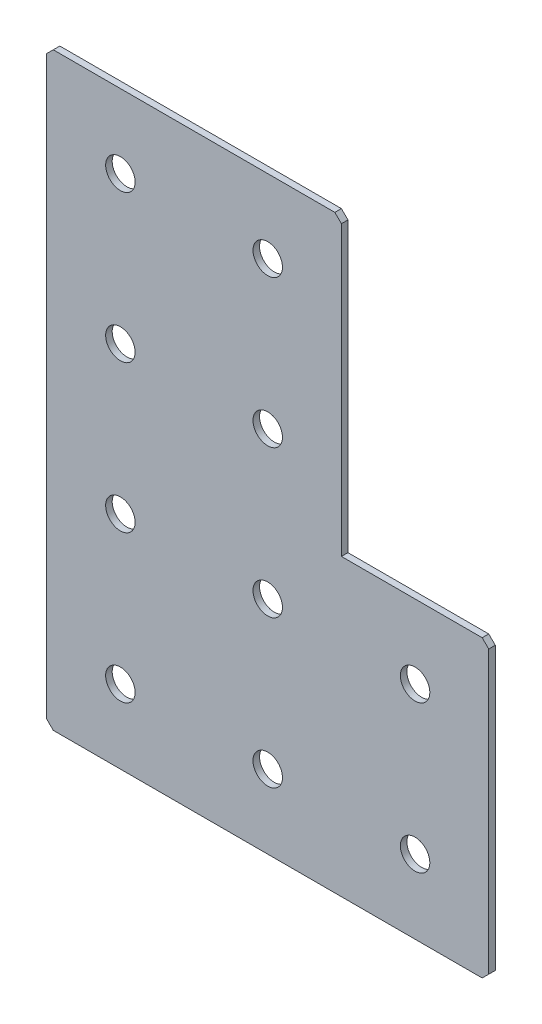
ISO-10303-21;
HEADER;
FILE_DESCRIPTION(('STEP AP214'),'2;1');
FILE_NAME('part.step','',(''),(''),'','','');
FILE_SCHEMA(('AUTOMOTIVE_DESIGN { 1 0 10303 214 1 1 1 1 }'));
ENDSEC;
DATA;
#1=APPLICATION_CONTEXT('core data for automotive mechanical design processes');
#2=APPLICATION_PROTOCOL_DEFINITION('international standard','automotive_design',2000,#1);
#3=PRODUCT_CONTEXT('',#1,'mechanical');
#4=PRODUCT('Part','Part','',(#3));
#5=PRODUCT_RELATED_PRODUCT_CATEGORY('part','',(#4));
#6=PRODUCT_DEFINITION_FORMATION('','',#4);
#7=PRODUCT_DEFINITION_CONTEXT('part definition',#1,'design');
#8=PRODUCT_DEFINITION('design','',#6,#7);
#9=PRODUCT_DEFINITION_SHAPE('','',#8);
#10=(LENGTH_UNIT() NAMED_UNIT(*) SI_UNIT(.MILLI.,.METRE.));
#11=(NAMED_UNIT(*) PLANE_ANGLE_UNIT() SI_UNIT($,.RADIAN.));
#12=(NAMED_UNIT(*) SI_UNIT($,.STERADIAN.) SOLID_ANGLE_UNIT());
#13=UNCERTAINTY_MEASURE_WITH_UNIT(LENGTH_MEASURE(1.E-05),#10,'distance_accuracy_value','');
#14=(GEOMETRIC_REPRESENTATION_CONTEXT(3) GLOBAL_UNCERTAINTY_ASSIGNED_CONTEXT((#13)) GLOBAL_UNIT_ASSIGNED_CONTEXT((#10,
#11,#12)) REPRESENTATION_CONTEXT('',''));
#15=CARTESIAN_POINT('',(0.,0.,0.));
#16=DIRECTION('',(0.,0.,1.));
#17=DIRECTION('',(1.,0.,0.));
#18=AXIS2_PLACEMENT_3D('',#15,#16,#17);
#19=CARTESIAN_POINT('',(90.,0.,-2.));
#20=DIRECTION('',(0.,-1.,0.));
#21=DIRECTION('',(1.,0.,0.));
#22=AXIS2_PLACEMENT_3D('',#19,#20,#21);
#23=PLANE('',#22);
#24=DIRECTION('',(1.,0.,0.));
#25=VECTOR('',#24,1.);
#26=CARTESIAN_POINT('',(90.,0.,0.));
#27=LINE('',#26,#25);
#28=CARTESIAN_POINT('',(2.00000000000003,0.,0.));
#29=VERTEX_POINT('',#28);
#30=CARTESIAN_POINT('',(88.,0.,0.));
#31=VERTEX_POINT('',#30);
#32=EDGE_CURVE('E158',#29,#31,#27,.T.);
#33=ORIENTED_EDGE('',*,*,#32,.T.);
#34=DIRECTION('',(0.,0.,-1.));
#35=VECTOR('',#34,1.);
#36=CARTESIAN_POINT('',(88.,0.,-2.));
#37=LINE('',#36,#35);
#38=CARTESIAN_POINT('',(88.,0.,-2.));
#39=VERTEX_POINT('',#38);
#40=EDGE_CURVE('E201',#31,#39,#37,.T.);
#41=ORIENTED_EDGE('',*,*,#40,.T.);
#42=DIRECTION('',(1.,0.,0.));
#43=VECTOR('',#42,1.);
#44=CARTESIAN_POINT('',(90.,0.,-2.));
#45=LINE('',#44,#43);
#46=CARTESIAN_POINT('',(2.00000000000003,0.,-2.));
#47=VERTEX_POINT('',#46);
#48=EDGE_CURVE('E133',#47,#39,#45,.T.);
#49=ORIENTED_EDGE('',*,*,#48,.F.);
#50=DIRECTION('',(0.,0.,1.));
#51=VECTOR('',#50,1.);
#52=CARTESIAN_POINT('',(2.,0.,-2.));
#53=LINE('',#52,#51);
#54=EDGE_CURVE('E198',#47,#29,#53,.T.);
#55=ORIENTED_EDGE('',*,*,#54,.T.);
#56=EDGE_LOOP('',(#33,#41,#49,#55));
#57=FACE_BOUND('',#56,.T.);
#58=ADVANCED_FACE('F37',(#57),#23,.F.);
#59=CARTESIAN_POINT('',(90.,-90.,-2.));
#60=DIRECTION('',(-1.,0.,0.));
#61=DIRECTION('',(0.,-1.,0.));
#62=AXIS2_PLACEMENT_3D('',#59,#60,#61);
#63=PLANE('',#62);
#64=DIRECTION('',(0.,-1.,0.));
#65=VECTOR('',#64,1.);
#66=CARTESIAN_POINT('',(90.,-90.,-2.));
#67=LINE('',#66,#65);
#68=CARTESIAN_POINT('',(90.,-2.,-2.));
#69=VERTEX_POINT('',#68);
#70=CARTESIAN_POINT('',(90.,-90.,-2.));
#71=VERTEX_POINT('',#70);
#72=EDGE_CURVE('E121',#69,#71,#67,.T.);
#73=ORIENTED_EDGE('',*,*,#72,.F.);
#74=DIRECTION('',(0.,0.,1.));
#75=VECTOR('',#74,1.);
#76=CARTESIAN_POINT('',(90.,-1.99999999999997,-2.));
#77=LINE('',#76,#75);
#78=CARTESIAN_POINT('',(90.,-2.,0.));
#79=VERTEX_POINT('',#78);
#80=EDGE_CURVE('E196',#69,#79,#77,.T.);
#81=ORIENTED_EDGE('',*,*,#80,.T.);
#82=DIRECTION('',(0.,-1.,0.));
#83=VECTOR('',#82,1.);
#84=CARTESIAN_POINT('',(90.,-90.,0.));
#85=LINE('',#84,#83);
#86=CARTESIAN_POINT('',(90.,-90.,0.));
#87=VERTEX_POINT('',#86);
#88=EDGE_CURVE('E139',#79,#87,#85,.T.);
#89=ORIENTED_EDGE('',*,*,#88,.T.);
#90=DIRECTION('',(0.,0.,1.));
#91=VECTOR('',#90,1.);
#92=CARTESIAN_POINT('',(90.,-90.,-2.));
#93=LINE('',#92,#91);
#94=EDGE_CURVE('E136',#71,#87,#93,.T.);
#95=ORIENTED_EDGE('',*,*,#94,.F.);
#96=EDGE_LOOP('',(#73,#81,#89,#95));
#97=FACE_BOUND('',#96,.T.);
#98=ADVANCED_FACE('F137',(#97),#63,.F.);
#99=CARTESIAN_POINT('',(135.,-90.,-2.));
#100=DIRECTION('',(0.,-1.,0.));
#101=DIRECTION('',(0.,0.,-1.));
#102=AXIS2_PLACEMENT_3D('',#99,#100,#101);
#103=PLANE('',#102);
#104=DIRECTION('',(1.,0.,0.));
#105=VECTOR('',#104,1.);
#106=CARTESIAN_POINT('',(135.,-90.,0.));
#107=LINE('',#106,#105);
#108=CARTESIAN_POINT('',(133.,-90.,0.));
#109=VERTEX_POINT('',#108);
#110=EDGE_CURVE('E163',#87,#109,#107,.T.);
#111=ORIENTED_EDGE('',*,*,#110,.T.);
#112=DIRECTION('',(0.,0.,-1.));
#113=VECTOR('',#112,1.);
#114=CARTESIAN_POINT('',(133.,-90.,-2.));
#115=LINE('',#114,#113);
#116=CARTESIAN_POINT('',(133.,-90.,-2.));
#117=VERTEX_POINT('',#116);
#118=EDGE_CURVE('E148',#109,#117,#115,.T.);
#119=ORIENTED_EDGE('',*,*,#118,.T.);
#120=DIRECTION('',(1.,0.,0.));
#121=VECTOR('',#120,1.);
#122=CARTESIAN_POINT('',(135.,-90.,-2.));
#123=LINE('',#122,#121);
#124=EDGE_CURVE('E125',#71,#117,#123,.T.);
#125=ORIENTED_EDGE('',*,*,#124,.F.);
#126=ORIENTED_EDGE('',*,*,#94,.T.);
#127=EDGE_LOOP('',(#111,#119,#125,#126));
#128=FACE_BOUND('',#127,.T.);
#129=ADVANCED_FACE('F146',(#128),#103,.F.);
#130=CARTESIAN_POINT('',(135.,-180.,-2.));
#131=DIRECTION('',(-1.,0.,0.));
#132=DIRECTION('',(0.,-1.,0.));
#133=AXIS2_PLACEMENT_3D('',#130,#131,#132);
#134=PLANE('',#133);
#135=DIRECTION('',(0.,-1.,0.));
#136=VECTOR('',#135,1.);
#137=CARTESIAN_POINT('',(135.,-180.,-2.));
#138=LINE('',#137,#136);
#139=CARTESIAN_POINT('',(135.,-92.,-2.));
#140=VERTEX_POINT('',#139);
#141=CARTESIAN_POINT('',(135.,-178.,-2.));
#142=VERTEX_POINT('',#141);
#143=EDGE_CURVE('E149',#140,#142,#138,.T.);
#144=ORIENTED_EDGE('',*,*,#143,.F.);
#145=DIRECTION('',(0.,0.,1.));
#146=VECTOR('',#145,1.);
#147=CARTESIAN_POINT('',(135.,-92.,-2.));
#148=LINE('',#147,#146);
#149=CARTESIAN_POINT('',(135.,-92.,0.));
#150=VERTEX_POINT('',#149);
#151=EDGE_CURVE('E174',#140,#150,#148,.T.);
#152=ORIENTED_EDGE('',*,*,#151,.T.);
#153=DIRECTION('',(0.,-1.,0.));
#154=VECTOR('',#153,1.);
#155=CARTESIAN_POINT('',(135.,-180.,0.));
#156=LINE('',#155,#154);
#157=CARTESIAN_POINT('',(135.,-178.,0.));
#158=VERTEX_POINT('',#157);
#159=EDGE_CURVE('E165',#150,#158,#156,.T.);
#160=ORIENTED_EDGE('',*,*,#159,.T.);
#161=DIRECTION('',(0.,0.,-1.));
#162=VECTOR('',#161,1.);
#163=CARTESIAN_POINT('',(135.,-178.,-2.));
#164=LINE('',#163,#162);
#165=EDGE_CURVE('E143',#158,#142,#164,.T.);
#166=ORIENTED_EDGE('',*,*,#165,.T.);
#167=EDGE_LOOP('',(#144,#152,#160,#166));
#168=FACE_BOUND('',#167,.T.);
#169=ADVANCED_FACE('F353',(#168),#134,.F.);
#170=CARTESIAN_POINT('',(0.,-180.,-2.));
#171=DIRECTION('',(0.,1.,0.));
#172=DIRECTION('',(0.,0.,1.));
#173=AXIS2_PLACEMENT_3D('',#170,#171,#172);
#174=PLANE('',#173);
#175=DIRECTION('',(-1.,0.,0.));
#176=VECTOR('',#175,1.);
#177=CARTESIAN_POINT('',(0.,-180.,-2.));
#178=LINE('',#177,#176);
#179=CARTESIAN_POINT('',(133.,-180.,-2.));
#180=VERTEX_POINT('',#179);
#181=CARTESIAN_POINT('',(1.99999999999997,-180.,-2.));
#182=VERTEX_POINT('',#181);
#183=EDGE_CURVE('E152',#180,#182,#178,.T.);
#184=ORIENTED_EDGE('',*,*,#183,.F.);
#185=DIRECTION('',(0.,0.,1.));
#186=VECTOR('',#185,1.);
#187=CARTESIAN_POINT('',(133.,-180.,-2.));
#188=LINE('',#187,#186);
#189=CARTESIAN_POINT('',(133.,-180.,0.));
#190=VERTEX_POINT('',#189);
#191=EDGE_CURVE('E11',#180,#190,#188,.T.);
#192=ORIENTED_EDGE('',*,*,#191,.T.);
#193=DIRECTION('',(-1.,0.,0.));
#194=VECTOR('',#193,1.);
#195=CARTESIAN_POINT('',(0.,-180.,0.));
#196=LINE('',#195,#194);
#197=CARTESIAN_POINT('',(1.99999999999997,-180.,0.));
#198=VERTEX_POINT('',#197);
#199=EDGE_CURVE('E168',#190,#198,#196,.T.);
#200=ORIENTED_EDGE('',*,*,#199,.T.);
#201=DIRECTION('',(0.,0.,-1.));
#202=VECTOR('',#201,1.);
#203=CARTESIAN_POINT('',(1.99999999999997,-180.,-2.));
#204=LINE('',#203,#202);
#205=EDGE_CURVE('E45',#198,#182,#204,.T.);
#206=ORIENTED_EDGE('',*,*,#205,.T.);
#207=EDGE_LOOP('',(#184,#192,#200,#206));
#208=FACE_BOUND('',#207,.T.);
#209=ADVANCED_FACE('F209',(#208),#174,.F.);
#210=CARTESIAN_POINT('',(0.,0.,-2.));
#211=DIRECTION('',(1.,0.,0.));
#212=DIRECTION('',(0.,0.,-1.));
#213=AXIS2_PLACEMENT_3D('',#210,#211,#212);
#214=PLANE('',#213);
#215=DIRECTION('',(0.,1.,0.));
#216=VECTOR('',#215,1.);
#217=CARTESIAN_POINT('',(0.,0.,0.));
#218=LINE('',#217,#216);
#219=CARTESIAN_POINT('',(0.,-178.,0.));
#220=VERTEX_POINT('',#219);
#221=CARTESIAN_POINT('',(0.,-2.,0.));
#222=VERTEX_POINT('',#221);
#223=EDGE_CURVE('E171',#220,#222,#218,.T.);
#224=ORIENTED_EDGE('',*,*,#223,.T.);
#225=DIRECTION('',(0.,0.,-1.));
#226=VECTOR('',#225,1.);
#227=CARTESIAN_POINT('',(0.,-2.,-2.));
#228=LINE('',#227,#226);
#229=CARTESIAN_POINT('',(0.,-2.,-2.));
#230=VERTEX_POINT('',#229);
#231=EDGE_CURVE('E52',#222,#230,#228,.T.);
#232=ORIENTED_EDGE('',*,*,#231,.T.);
#233=DIRECTION('',(0.,1.,0.));
#234=VECTOR('',#233,1.);
#235=CARTESIAN_POINT('',(0.,0.,-2.));
#236=LINE('',#235,#234);
#237=CARTESIAN_POINT('',(0.,-178.,-2.));
#238=VERTEX_POINT('',#237);
#239=EDGE_CURVE('E144',#238,#230,#236,.T.);
#240=ORIENTED_EDGE('',*,*,#239,.F.);
#241=DIRECTION('',(0.,0.,1.));
#242=VECTOR('',#241,1.);
#243=CARTESIAN_POINT('',(0.,-178.,-2.));
#244=LINE('',#243,#242);
#245=EDGE_CURVE('E203',#238,#220,#244,.T.);
#246=ORIENTED_EDGE('',*,*,#245,.T.);
#247=EDGE_LOOP('',(#224,#232,#240,#246));
#248=FACE_BOUND('',#247,.T.);
#249=ADVANCED_FACE('F216',(#248),#214,.F.);
#250=CARTESIAN_POINT('',(0.,0.,-2.));
#251=DIRECTION('',(0.,0.,1.));
#252=DIRECTION('',(1.,0.,0.));
#253=AXIS2_PLACEMENT_3D('',#250,#251,#252);
#254=PLANE('',#253);
#255=CARTESIAN_POINT('',(22.5,-157.5,-2.00000000000001));
#256=DIRECTION('',(0.,0.,-1.));
#257=DIRECTION('',(0.,1.,0.));
#258=AXIS2_PLACEMENT_3D('',#255,#256,#257);
#259=CIRCLE('',#258,4.5);
#260=CARTESIAN_POINT('',(22.5,-153.,-2.00000000000001));
#261=VERTEX_POINT('',#260);
#262=EDGE_CURVE('E285',#261,#261,#259,.T.);
#263=ORIENTED_EDGE('',*,*,#262,.F.);
#264=EDGE_LOOP('',(#263));
#265=FACE_BOUND('',#264,.T.);
#266=CARTESIAN_POINT('',(22.5,-112.5,-2.00000000000001));
#267=DIRECTION('',(0.,0.,-1.));
#268=DIRECTION('',(0.,1.,0.));
#269=AXIS2_PLACEMENT_3D('',#266,#267,#268);
#270=CIRCLE('',#269,4.5);
#271=CARTESIAN_POINT('',(22.5,-108.,-2.00000000000001));
#272=VERTEX_POINT('',#271);
#273=EDGE_CURVE('E279',#272,#272,#270,.T.);
#274=ORIENTED_EDGE('',*,*,#273,.F.);
#275=EDGE_LOOP('',(#274));
#276=FACE_BOUND('',#275,.T.);
#277=CARTESIAN_POINT('',(22.5,-67.5,-2.));
#278=DIRECTION('',(0.,0.,-1.));
#279=DIRECTION('',(0.,1.,0.));
#280=AXIS2_PLACEMENT_3D('',#277,#278,#279);
#281=CIRCLE('',#280,4.5);
#282=CARTESIAN_POINT('',(22.5,-63.,-2.));
#283=VERTEX_POINT('',#282);
#284=EDGE_CURVE('E273',#283,#283,#281,.T.);
#285=ORIENTED_EDGE('',*,*,#284,.F.);
#286=EDGE_LOOP('',(#285));
#287=FACE_BOUND('',#286,.T.);
#288=CARTESIAN_POINT('',(22.5,-22.5,-2.));
#289=DIRECTION('',(0.,0.,-1.));
#290=DIRECTION('',(0.,1.,0.));
#291=AXIS2_PLACEMENT_3D('',#288,#289,#290);
#292=CIRCLE('',#291,4.5);
#293=CARTESIAN_POINT('',(22.5,-18.,-2.));
#294=VERTEX_POINT('',#293);
#295=EDGE_CURVE('E267',#294,#294,#292,.T.);
#296=ORIENTED_EDGE('',*,*,#295,.F.);
#297=EDGE_LOOP('',(#296));
#298=FACE_BOUND('',#297,.T.);
#299=CARTESIAN_POINT('',(67.5,-157.5,-2.00000000000001));
#300=DIRECTION('',(0.,0.,-1.));
#301=DIRECTION('',(0.,1.,0.));
#302=AXIS2_PLACEMENT_3D('',#299,#300,#301);
#303=CIRCLE('',#302,4.5);
#304=CARTESIAN_POINT('',(67.5,-153.,-2.00000000000001));
#305=VERTEX_POINT('',#304);
#306=EDGE_CURVE('E261',#305,#305,#303,.T.);
#307=ORIENTED_EDGE('',*,*,#306,.F.);
#308=EDGE_LOOP('',(#307));
#309=FACE_BOUND('',#308,.T.);
#310=CARTESIAN_POINT('',(67.5,-112.5,-2.00000000000001));
#311=DIRECTION('',(0.,0.,-1.));
#312=DIRECTION('',(0.,1.,0.));
#313=AXIS2_PLACEMENT_3D('',#310,#311,#312);
#314=CIRCLE('',#313,4.5);
#315=CARTESIAN_POINT('',(67.5,-108.,-2.00000000000001));
#316=VERTEX_POINT('',#315);
#317=EDGE_CURVE('E255',#316,#316,#314,.T.);
#318=ORIENTED_EDGE('',*,*,#317,.F.);
#319=EDGE_LOOP('',(#318));
#320=FACE_BOUND('',#319,.T.);
#321=CARTESIAN_POINT('',(67.5,-67.5,-2.));
#322=DIRECTION('',(0.,0.,-1.));
#323=DIRECTION('',(0.,1.,0.));
#324=AXIS2_PLACEMENT_3D('',#321,#322,#323);
#325=CIRCLE('',#324,4.5);
#326=CARTESIAN_POINT('',(67.5,-63.,-2.));
#327=VERTEX_POINT('',#326);
#328=EDGE_CURVE('E249',#327,#327,#325,.T.);
#329=ORIENTED_EDGE('',*,*,#328,.F.);
#330=EDGE_LOOP('',(#329));
#331=FACE_BOUND('',#330,.T.);
#332=CARTESIAN_POINT('',(67.5,-22.5,-2.));
#333=DIRECTION('',(0.,0.,-1.));
#334=DIRECTION('',(0.,1.,0.));
#335=AXIS2_PLACEMENT_3D('',#332,#333,#334);
#336=CIRCLE('',#335,4.5);
#337=CARTESIAN_POINT('',(67.5,-18.,-2.));
#338=VERTEX_POINT('',#337);
#339=EDGE_CURVE('E243',#338,#338,#336,.T.);
#340=ORIENTED_EDGE('',*,*,#339,.F.);
#341=EDGE_LOOP('',(#340));
#342=FACE_BOUND('',#341,.T.);
#343=CARTESIAN_POINT('',(112.5,-157.5,-2.00000000000001));
#344=DIRECTION('',(0.,0.,-1.));
#345=DIRECTION('',(0.,1.,0.));
#346=AXIS2_PLACEMENT_3D('',#343,#344,#345);
#347=CIRCLE('',#346,4.5);
#348=CARTESIAN_POINT('',(112.5,-153.,-2.00000000000001));
#349=VERTEX_POINT('',#348);
#350=EDGE_CURVE('E237',#349,#349,#347,.T.);
#351=ORIENTED_EDGE('',*,*,#350,.F.);
#352=EDGE_LOOP('',(#351));
#353=FACE_BOUND('',#352,.T.);
#354=CARTESIAN_POINT('',(112.5,-112.5,-2.00000000000001));
#355=DIRECTION('',(0.,0.,-1.));
#356=DIRECTION('',(0.,1.,0.));
#357=AXIS2_PLACEMENT_3D('',#354,#355,#356);
#358=CIRCLE('',#357,4.5);
#359=CARTESIAN_POINT('',(112.5,-108.,-2.00000000000001));
#360=VERTEX_POINT('',#359);
#361=EDGE_CURVE('E231',#360,#360,#358,.T.);
#362=ORIENTED_EDGE('',*,*,#361,.F.);
#363=EDGE_LOOP('',(#362));
#364=FACE_BOUND('',#363,.T.);
#365=ORIENTED_EDGE('',*,*,#124,.T.);
#366=DIRECTION('',(-0.707106781186552,0.707106781186543,0.));
#367=VECTOR('',#366,1.);
#368=CARTESIAN_POINT('',(135.,-92.,-2.));
#369=LINE('',#368,#367);
#370=EDGE_CURVE('E194',#117,#140,#369,.F.);
#371=ORIENTED_EDGE('',*,*,#370,.T.);
#372=ORIENTED_EDGE('',*,*,#143,.T.);
#373=DIRECTION('',(0.707106781186548,0.707106781186548,0.));
#374=VECTOR('',#373,1.);
#375=CARTESIAN_POINT('',(133.,-180.,-2.));
#376=LINE('',#375,#374);
#377=EDGE_CURVE('E189',#142,#180,#376,.F.);
#378=ORIENTED_EDGE('',*,*,#377,.T.);
#379=ORIENTED_EDGE('',*,*,#183,.T.);
#380=DIRECTION('',(0.707106781186548,-0.707106781186548,0.));
#381=VECTOR('',#380,1.);
#382=CARTESIAN_POINT('',(0.,-178.,-2.));
#383=LINE('',#382,#381);
#384=EDGE_CURVE('E59',#182,#238,#383,.F.);
#385=ORIENTED_EDGE('',*,*,#384,.T.);
#386=ORIENTED_EDGE('',*,*,#239,.T.);
#387=DIRECTION('',(-0.707106781186548,-0.707106781186548,0.));
#388=VECTOR('',#387,1.);
#389=CARTESIAN_POINT('',(2.,0.,-2.));
#390=LINE('',#389,#388);
#391=EDGE_CURVE('E191',#230,#47,#390,.F.);
#392=ORIENTED_EDGE('',*,*,#391,.T.);
#393=ORIENTED_EDGE('',*,*,#48,.T.);
#394=DIRECTION('',(-0.707106781186548,0.707106781186547,0.));
#395=VECTOR('',#394,1.);
#396=CARTESIAN_POINT('',(90.,-1.99999999999997,-2.));
#397=LINE('',#396,#395);
#398=EDGE_CURVE('E129',#39,#69,#397,.F.);
#399=ORIENTED_EDGE('',*,*,#398,.T.);
#400=ORIENTED_EDGE('',*,*,#72,.T.);
#401=EDGE_LOOP('',(#365,#371,#372,#378,#379,#385,#386,#392,#393,#399,#400));
#402=FACE_BOUND('',#401,.T.);
#403=ADVANCED_FACE('F123',(#265,#276,#287,#298,#309,#320,#331,#342,#353,#364,#402),#254,.F.);
#404=CARTESIAN_POINT('',(0.,0.,0.));
#405=DIRECTION('',(0.,0.,1.));
#406=DIRECTION('',(1.,0.,0.));
#407=AXIS2_PLACEMENT_3D('',#404,#405,#406);
#408=PLANE('',#407);
#409=CARTESIAN_POINT('',(22.5,-157.5,0.));
#410=DIRECTION('',(0.,0.,-1.));
#411=DIRECTION('',(0.,1.,0.));
#412=AXIS2_PLACEMENT_3D('',#409,#410,#411);
#413=CIRCLE('',#412,4.5);
#414=CARTESIAN_POINT('',(22.5,-153.,0.));
#415=VERTEX_POINT('',#414);
#416=EDGE_CURVE('E282',#415,#415,#413,.T.);
#417=ORIENTED_EDGE('',*,*,#416,.T.);
#418=EDGE_LOOP('',(#417));
#419=FACE_BOUND('',#418,.T.);
#420=CARTESIAN_POINT('',(22.5,-112.5,0.));
#421=DIRECTION('',(0.,0.,-1.));
#422=DIRECTION('',(0.,1.,0.));
#423=AXIS2_PLACEMENT_3D('',#420,#421,#422);
#424=CIRCLE('',#423,4.5);
#425=CARTESIAN_POINT('',(22.5,-108.,0.));
#426=VERTEX_POINT('',#425);
#427=EDGE_CURVE('E276',#426,#426,#424,.T.);
#428=ORIENTED_EDGE('',*,*,#427,.T.);
#429=EDGE_LOOP('',(#428));
#430=FACE_BOUND('',#429,.T.);
#431=CARTESIAN_POINT('',(22.5,-67.5,0.));
#432=DIRECTION('',(0.,0.,-1.));
#433=DIRECTION('',(0.,1.,0.));
#434=AXIS2_PLACEMENT_3D('',#431,#432,#433);
#435=CIRCLE('',#434,4.5);
#436=CARTESIAN_POINT('',(22.5,-63.,0.));
#437=VERTEX_POINT('',#436);
#438=EDGE_CURVE('E270',#437,#437,#435,.T.);
#439=ORIENTED_EDGE('',*,*,#438,.T.);
#440=EDGE_LOOP('',(#439));
#441=FACE_BOUND('',#440,.T.);
#442=CARTESIAN_POINT('',(22.5,-22.5,0.));
#443=DIRECTION('',(0.,0.,-1.));
#444=DIRECTION('',(0.,1.,0.));
#445=AXIS2_PLACEMENT_3D('',#442,#443,#444);
#446=CIRCLE('',#445,4.5);
#447=CARTESIAN_POINT('',(22.5,-18.,0.));
#448=VERTEX_POINT('',#447);
#449=EDGE_CURVE('E264',#448,#448,#446,.T.);
#450=ORIENTED_EDGE('',*,*,#449,.T.);
#451=EDGE_LOOP('',(#450));
#452=FACE_BOUND('',#451,.T.);
#453=CARTESIAN_POINT('',(67.5,-157.5,0.));
#454=DIRECTION('',(0.,0.,-1.));
#455=DIRECTION('',(0.,1.,0.));
#456=AXIS2_PLACEMENT_3D('',#453,#454,#455);
#457=CIRCLE('',#456,4.5);
#458=CARTESIAN_POINT('',(67.5,-153.,0.));
#459=VERTEX_POINT('',#458);
#460=EDGE_CURVE('E258',#459,#459,#457,.T.);
#461=ORIENTED_EDGE('',*,*,#460,.T.);
#462=EDGE_LOOP('',(#461));
#463=FACE_BOUND('',#462,.T.);
#464=CARTESIAN_POINT('',(67.5,-112.5,0.));
#465=DIRECTION('',(0.,0.,-1.));
#466=DIRECTION('',(0.,1.,0.));
#467=AXIS2_PLACEMENT_3D('',#464,#465,#466);
#468=CIRCLE('',#467,4.5);
#469=CARTESIAN_POINT('',(67.5,-108.,0.));
#470=VERTEX_POINT('',#469);
#471=EDGE_CURVE('E252',#470,#470,#468,.T.);
#472=ORIENTED_EDGE('',*,*,#471,.T.);
#473=EDGE_LOOP('',(#472));
#474=FACE_BOUND('',#473,.T.);
#475=CARTESIAN_POINT('',(67.5,-67.5,0.));
#476=DIRECTION('',(0.,0.,-1.));
#477=DIRECTION('',(0.,1.,0.));
#478=AXIS2_PLACEMENT_3D('',#475,#476,#477);
#479=CIRCLE('',#478,4.5);
#480=CARTESIAN_POINT('',(67.5,-63.,0.));
#481=VERTEX_POINT('',#480);
#482=EDGE_CURVE('E246',#481,#481,#479,.T.);
#483=ORIENTED_EDGE('',*,*,#482,.T.);
#484=EDGE_LOOP('',(#483));
#485=FACE_BOUND('',#484,.T.);
#486=CARTESIAN_POINT('',(67.5,-22.5,0.));
#487=DIRECTION('',(0.,0.,-1.));
#488=DIRECTION('',(0.,1.,0.));
#489=AXIS2_PLACEMENT_3D('',#486,#487,#488);
#490=CIRCLE('',#489,4.5);
#491=CARTESIAN_POINT('',(67.5,-18.,0.));
#492=VERTEX_POINT('',#491);
#493=EDGE_CURVE('E240',#492,#492,#490,.T.);
#494=ORIENTED_EDGE('',*,*,#493,.T.);
#495=EDGE_LOOP('',(#494));
#496=FACE_BOUND('',#495,.T.);
#497=CARTESIAN_POINT('',(112.5,-157.5,0.));
#498=DIRECTION('',(0.,0.,-1.));
#499=DIRECTION('',(0.,1.,0.));
#500=AXIS2_PLACEMENT_3D('',#497,#498,#499);
#501=CIRCLE('',#500,4.5);
#502=CARTESIAN_POINT('',(112.5,-153.,0.));
#503=VERTEX_POINT('',#502);
#504=EDGE_CURVE('E234',#503,#503,#501,.T.);
#505=ORIENTED_EDGE('',*,*,#504,.T.);
#506=EDGE_LOOP('',(#505));
#507=FACE_BOUND('',#506,.T.);
#508=CARTESIAN_POINT('',(112.5,-112.5,0.));
#509=DIRECTION('',(0.,0.,-1.));
#510=DIRECTION('',(0.,1.,0.));
#511=AXIS2_PLACEMENT_3D('',#508,#509,#510);
#512=CIRCLE('',#511,4.5);
#513=CARTESIAN_POINT('',(112.5,-108.,0.));
#514=VERTEX_POINT('',#513);
#515=EDGE_CURVE('E161',#514,#514,#512,.T.);
#516=ORIENTED_EDGE('',*,*,#515,.T.);
#517=EDGE_LOOP('',(#516));
#518=FACE_BOUND('',#517,.T.);
#519=ORIENTED_EDGE('',*,*,#159,.F.);
#520=DIRECTION('',(0.707106781186552,-0.707106781186543,0.));
#521=VECTOR('',#520,1.);
#522=CARTESIAN_POINT('',(21.4999999999991,21.4999999999994,0.));
#523=LINE('',#522,#521);
#524=EDGE_CURVE('E185',#150,#109,#523,.F.);
#525=ORIENTED_EDGE('',*,*,#524,.T.);
#526=ORIENTED_EDGE('',*,*,#110,.F.);
#527=ORIENTED_EDGE('',*,*,#88,.F.);
#528=DIRECTION('',(0.707106781186548,-0.707106781186547,0.));
#529=VECTOR('',#528,1.);
#530=CARTESIAN_POINT('',(44.,44.,0.));
#531=LINE('',#530,#529);
#532=EDGE_CURVE('E183',#79,#31,#531,.F.);
#533=ORIENTED_EDGE('',*,*,#532,.T.);
#534=ORIENTED_EDGE('',*,*,#32,.F.);
#535=DIRECTION('',(0.707106781186548,0.707106781186548,0.));
#536=VECTOR('',#535,1.);
#537=CARTESIAN_POINT('',(1.,-1.,0.));
#538=LINE('',#537,#536);
#539=EDGE_CURVE('E181',#29,#222,#538,.F.);
#540=ORIENTED_EDGE('',*,*,#539,.T.);
#541=ORIENTED_EDGE('',*,*,#223,.F.);
#542=DIRECTION('',(-0.707106781186548,0.707106781186548,0.));
#543=VECTOR('',#542,1.);
#544=CARTESIAN_POINT('',(-89.,-89.,0.));
#545=LINE('',#544,#543);
#546=EDGE_CURVE('E177',#220,#198,#545,.F.);
#547=ORIENTED_EDGE('',*,*,#546,.T.);
#548=ORIENTED_EDGE('',*,*,#199,.F.);
#549=DIRECTION('',(-0.707106781186548,-0.707106781186548,0.));
#550=VECTOR('',#549,1.);
#551=CARTESIAN_POINT('',(156.5,-156.5,0.));
#552=LINE('',#551,#550);
#553=EDGE_CURVE('E179',#190,#158,#552,.F.);
#554=ORIENTED_EDGE('',*,*,#553,.T.);
#555=EDGE_LOOP('',(#519,#525,#526,#527,#533,#534,#540,#541,#547,#548,#554));
#556=FACE_BOUND('',#555,.T.);
#557=ADVANCED_FACE('F219',(#419,#430,#441,#452,#463,#474,#485,#496,#507,#518,#556),#408,.T.);
#558=CARTESIAN_POINT('',(112.5,-112.5,-2.00000000000001));
#559=DIRECTION('',(0.,0.,-1.));
#560=DIRECTION('',(0.,1.,0.));
#561=AXIS2_PLACEMENT_3D('',#558,#559,#560);
#562=CYLINDRICAL_SURFACE('',#561,4.5);
#563=ORIENTED_EDGE('',*,*,#515,.F.);
#564=EDGE_LOOP('',(#563));
#565=FACE_BOUND('',#564,.T.);
#566=ORIENTED_EDGE('',*,*,#361,.T.);
#567=EDGE_LOOP('',(#566));
#568=FACE_BOUND('',#567,.T.);
#569=ADVANCED_FACE('F312',(#565,#568),#562,.F.);
#570=CARTESIAN_POINT('',(112.5,-157.5,-2.00000000000001));
#571=DIRECTION('',(0.,0.,-1.));
#572=DIRECTION('',(0.,1.,0.));
#573=AXIS2_PLACEMENT_3D('',#570,#571,#572);
#574=CYLINDRICAL_SURFACE('',#573,4.5);
#575=ORIENTED_EDGE('',*,*,#504,.F.);
#576=EDGE_LOOP('',(#575));
#577=FACE_BOUND('',#576,.T.);
#578=ORIENTED_EDGE('',*,*,#350,.T.);
#579=EDGE_LOOP('',(#578));
#580=FACE_BOUND('',#579,.T.);
#581=ADVANCED_FACE('F314',(#577,#580),#574,.F.);
#582=CARTESIAN_POINT('',(67.5,-22.5,-2.));
#583=DIRECTION('',(0.,0.,-1.));
#584=DIRECTION('',(0.,1.,0.));
#585=AXIS2_PLACEMENT_3D('',#582,#583,#584);
#586=CYLINDRICAL_SURFACE('',#585,4.5);
#587=ORIENTED_EDGE('',*,*,#493,.F.);
#588=EDGE_LOOP('',(#587));
#589=FACE_BOUND('',#588,.T.);
#590=ORIENTED_EDGE('',*,*,#339,.T.);
#591=EDGE_LOOP('',(#590));
#592=FACE_BOUND('',#591,.T.);
#593=ADVANCED_FACE('F321',(#589,#592),#586,.F.);
#594=CARTESIAN_POINT('',(67.5,-67.5,-2.));
#595=DIRECTION('',(0.,0.,-1.));
#596=DIRECTION('',(0.,1.,0.));
#597=AXIS2_PLACEMENT_3D('',#594,#595,#596);
#598=CYLINDRICAL_SURFACE('',#597,4.5);
#599=ORIENTED_EDGE('',*,*,#482,.F.);
#600=EDGE_LOOP('',(#599));
#601=FACE_BOUND('',#600,.T.);
#602=ORIENTED_EDGE('',*,*,#328,.T.);
#603=EDGE_LOOP('',(#602));
#604=FACE_BOUND('',#603,.T.);
#605=ADVANCED_FACE('F453',(#601,#604),#598,.F.);
#606=CARTESIAN_POINT('',(67.5,-112.5,-2.00000000000001));
#607=DIRECTION('',(0.,0.,-1.));
#608=DIRECTION('',(0.,1.,0.));
#609=AXIS2_PLACEMENT_3D('',#606,#607,#608);
#610=CYLINDRICAL_SURFACE('',#609,4.5);
#611=ORIENTED_EDGE('',*,*,#471,.F.);
#612=EDGE_LOOP('',(#611));
#613=FACE_BOUND('',#612,.T.);
#614=ORIENTED_EDGE('',*,*,#317,.T.);
#615=EDGE_LOOP('',(#614));
#616=FACE_BOUND('',#615,.T.);
#617=ADVANCED_FACE('F445',(#613,#616),#610,.F.);
#618=CARTESIAN_POINT('',(67.5,-157.5,-2.00000000000001));
#619=DIRECTION('',(0.,0.,-1.));
#620=DIRECTION('',(0.,1.,0.));
#621=AXIS2_PLACEMENT_3D('',#618,#619,#620);
#622=CYLINDRICAL_SURFACE('',#621,4.5);
#623=ORIENTED_EDGE('',*,*,#460,.F.);
#624=EDGE_LOOP('',(#623));
#625=FACE_BOUND('',#624,.T.);
#626=ORIENTED_EDGE('',*,*,#306,.T.);
#627=EDGE_LOOP('',(#626));
#628=FACE_BOUND('',#627,.T.);
#629=ADVANCED_FACE('F437',(#625,#628),#622,.F.);
#630=CARTESIAN_POINT('',(22.5,-22.5,-2.));
#631=DIRECTION('',(0.,0.,-1.));
#632=DIRECTION('',(0.,1.,0.));
#633=AXIS2_PLACEMENT_3D('',#630,#631,#632);
#634=CYLINDRICAL_SURFACE('',#633,4.5);
#635=ORIENTED_EDGE('',*,*,#449,.F.);
#636=EDGE_LOOP('',(#635));
#637=FACE_BOUND('',#636,.T.);
#638=ORIENTED_EDGE('',*,*,#295,.T.);
#639=EDGE_LOOP('',(#638));
#640=FACE_BOUND('',#639,.T.);
#641=ADVANCED_FACE('F429',(#637,#640),#634,.F.);
#642=CARTESIAN_POINT('',(22.5,-67.5,-2.));
#643=DIRECTION('',(0.,0.,-1.));
#644=DIRECTION('',(0.,1.,0.));
#645=AXIS2_PLACEMENT_3D('',#642,#643,#644);
#646=CYLINDRICAL_SURFACE('',#645,4.5);
#647=ORIENTED_EDGE('',*,*,#438,.F.);
#648=EDGE_LOOP('',(#647));
#649=FACE_BOUND('',#648,.T.);
#650=ORIENTED_EDGE('',*,*,#284,.T.);
#651=EDGE_LOOP('',(#650));
#652=FACE_BOUND('',#651,.T.);
#653=ADVANCED_FACE('F421',(#649,#652),#646,.F.);
#654=CARTESIAN_POINT('',(22.5,-112.5,-2.00000000000001));
#655=DIRECTION('',(0.,0.,-1.));
#656=DIRECTION('',(0.,1.,0.));
#657=AXIS2_PLACEMENT_3D('',#654,#655,#656);
#658=CYLINDRICAL_SURFACE('',#657,4.5);
#659=ORIENTED_EDGE('',*,*,#427,.F.);
#660=EDGE_LOOP('',(#659));
#661=FACE_BOUND('',#660,.T.);
#662=ORIENTED_EDGE('',*,*,#273,.T.);
#663=EDGE_LOOP('',(#662));
#664=FACE_BOUND('',#663,.T.);
#665=ADVANCED_FACE('F414',(#661,#664),#658,.F.);
#666=CARTESIAN_POINT('',(22.5,-157.5,-2.00000000000001));
#667=DIRECTION('',(0.,0.,-1.));
#668=DIRECTION('',(0.,1.,0.));
#669=AXIS2_PLACEMENT_3D('',#666,#667,#668);
#670=CYLINDRICAL_SURFACE('',#669,4.5);
#671=ORIENTED_EDGE('',*,*,#416,.F.);
#672=EDGE_LOOP('',(#671));
#673=FACE_BOUND('',#672,.T.);
#674=ORIENTED_EDGE('',*,*,#262,.T.);
#675=EDGE_LOOP('',(#674));
#676=FACE_BOUND('',#675,.T.);
#677=ADVANCED_FACE('F289',(#673,#676),#670,.F.);
#678=CARTESIAN_POINT('',(135.,-92.,-2.));
#679=DIRECTION('',(-0.707106781186542,-0.707106781186552,0.));
#680=DIRECTION('',(0.,0.,1.));
#681=AXIS2_PLACEMENT_3D('',#678,#679,#680);
#682=PLANE('',#681);
#683=ORIENTED_EDGE('',*,*,#370,.F.);
#684=ORIENTED_EDGE('',*,*,#118,.F.);
#685=ORIENTED_EDGE('',*,*,#524,.F.);
#686=ORIENTED_EDGE('',*,*,#151,.F.);
#687=EDGE_LOOP('',(#683,#684,#685,#686));
#688=FACE_BOUND('',#687,.T.);
#689=ADVANCED_FACE('F335',(#688),#682,.F.);
#690=CARTESIAN_POINT('',(90.,-1.99999999999997,-2.));
#691=DIRECTION('',(-0.707106781186547,-0.707106781186548,0.));
#692=DIRECTION('',(0.,0.,1.));
#693=AXIS2_PLACEMENT_3D('',#690,#691,#692);
#694=PLANE('',#693);
#695=ORIENTED_EDGE('',*,*,#398,.F.);
#696=ORIENTED_EDGE('',*,*,#40,.F.);
#697=ORIENTED_EDGE('',*,*,#532,.F.);
#698=ORIENTED_EDGE('',*,*,#80,.F.);
#699=EDGE_LOOP('',(#695,#696,#697,#698));
#700=FACE_BOUND('',#699,.T.);
#701=ADVANCED_FACE('F338',(#700),#694,.F.);
#702=CARTESIAN_POINT('',(2.,0.,-2.));
#703=DIRECTION('',(0.707106781186547,-0.707106781186547,0.));
#704=DIRECTION('',(0.,0.,1.));
#705=AXIS2_PLACEMENT_3D('',#702,#703,#704);
#706=PLANE('',#705);
#707=ORIENTED_EDGE('',*,*,#391,.F.);
#708=ORIENTED_EDGE('',*,*,#231,.F.);
#709=ORIENTED_EDGE('',*,*,#539,.F.);
#710=ORIENTED_EDGE('',*,*,#54,.F.);
#711=EDGE_LOOP('',(#707,#708,#709,#710));
#712=FACE_BOUND('',#711,.T.);
#713=ADVANCED_FACE('F224',(#712),#706,.F.);
#714=CARTESIAN_POINT('',(133.,-180.,-2.));
#715=DIRECTION('',(-0.707106781186547,0.707106781186547,0.));
#716=DIRECTION('',(0.,0.,1.));
#717=AXIS2_PLACEMENT_3D('',#714,#715,#716);
#718=PLANE('',#717);
#719=ORIENTED_EDGE('',*,*,#377,.F.);
#720=ORIENTED_EDGE('',*,*,#165,.F.);
#721=ORIENTED_EDGE('',*,*,#553,.F.);
#722=ORIENTED_EDGE('',*,*,#191,.F.);
#723=EDGE_LOOP('',(#719,#720,#721,#722));
#724=FACE_BOUND('',#723,.T.);
#725=ADVANCED_FACE('F344',(#724),#718,.F.);
#726=CARTESIAN_POINT('',(0.,-178.,-2.));
#727=DIRECTION('',(0.707106781186547,0.707106781186547,0.));
#728=DIRECTION('',(0.,0.,1.));
#729=AXIS2_PLACEMENT_3D('',#726,#727,#728);
#730=PLANE('',#729);
#731=ORIENTED_EDGE('',*,*,#384,.F.);
#732=ORIENTED_EDGE('',*,*,#205,.F.);
#733=ORIENTED_EDGE('',*,*,#546,.F.);
#734=ORIENTED_EDGE('',*,*,#245,.F.);
#735=EDGE_LOOP('',(#731,#732,#733,#734));
#736=FACE_BOUND('',#735,.T.);
#737=ADVANCED_FACE('F39',(#736),#730,.F.);
#738=CLOSED_SHELL('',(#58,#98,#129,#169,#209,#249,#403,#557,#569,#581,#593,#605,#617,#629,#641,
#653,#665,#677,#689,#701,#713,#725,#737));
#739=MANIFOLD_SOLID_BREP('B2',#738);
#740=ADVANCED_BREP_SHAPE_REPRESENTATION('',(#18,#739),#14);
#741=SHAPE_DEFINITION_REPRESENTATION(#9,#740);
ENDSEC;
END-ISO-10303-21;
